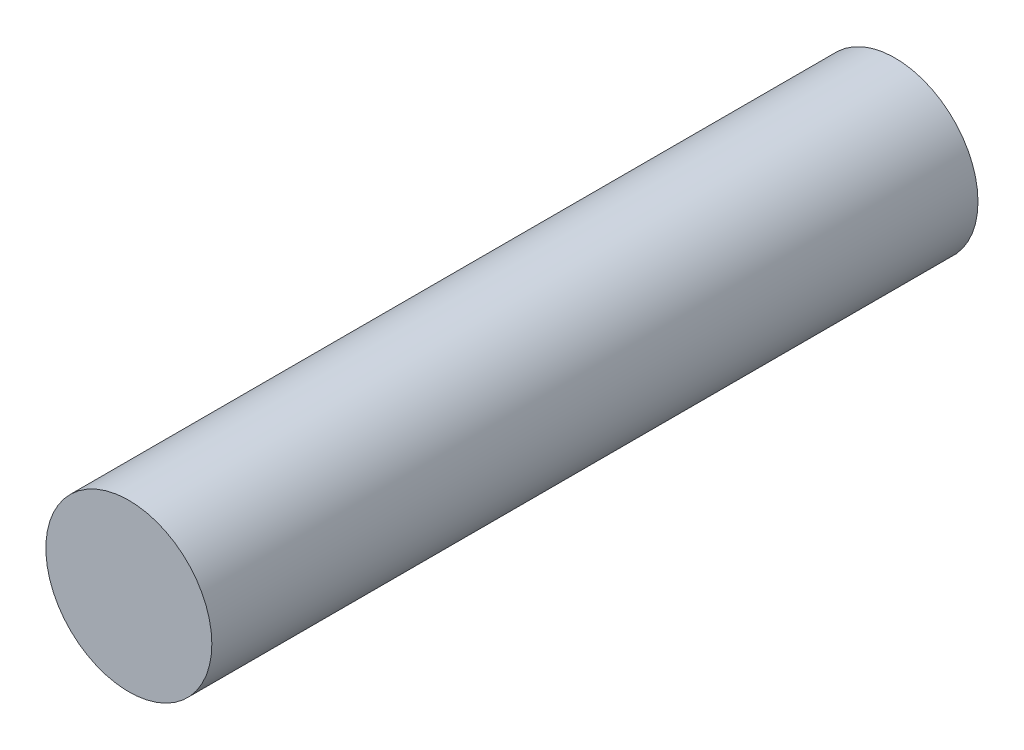
ISO-10303-21;
HEADER;
FILE_DESCRIPTION(('STEP AP214'),'2;1');
FILE_NAME('part.step','',(''),(''),'','','');
FILE_SCHEMA(('AUTOMOTIVE_DESIGN { 1 0 10303 214 1 1 1 1 }'));
ENDSEC;
DATA;
#1=APPLICATION_CONTEXT('core data for automotive mechanical design processes');
#2=APPLICATION_PROTOCOL_DEFINITION('international standard','automotive_design',2000,#1);
#3=PRODUCT_CONTEXT('',#1,'mechanical');
#4=PRODUCT('Part','Part','',(#3));
#5=PRODUCT_RELATED_PRODUCT_CATEGORY('part','',(#4));
#6=PRODUCT_DEFINITION_FORMATION('','',#4);
#7=PRODUCT_DEFINITION_CONTEXT('part definition',#1,'design');
#8=PRODUCT_DEFINITION('design','',#6,#7);
#9=PRODUCT_DEFINITION_SHAPE('','',#8);
#10=(LENGTH_UNIT() NAMED_UNIT(*) SI_UNIT(.MILLI.,.METRE.));
#11=(NAMED_UNIT(*) PLANE_ANGLE_UNIT() SI_UNIT($,.RADIAN.));
#12=(NAMED_UNIT(*) SI_UNIT($,.STERADIAN.) SOLID_ANGLE_UNIT());
#13=UNCERTAINTY_MEASURE_WITH_UNIT(LENGTH_MEASURE(1.E-05),#10,'distance_accuracy_value','');
#14=(GEOMETRIC_REPRESENTATION_CONTEXT(3) GLOBAL_UNCERTAINTY_ASSIGNED_CONTEXT((#13)) GLOBAL_UNIT_ASSIGNED_CONTEXT((#10,
#11,#12)) REPRESENTATION_CONTEXT('',''));
#15=CARTESIAN_POINT('',(0.,0.,0.));
#16=DIRECTION('',(0.,0.,1.));
#17=DIRECTION('',(1.,0.,0.));
#18=AXIS2_PLACEMENT_3D('',#15,#16,#17);
#19=CARTESIAN_POINT('',(0.,0.,-29.9999999999999));
#20=DIRECTION('',(0.,0.,0.999999999999997));
#21=DIRECTION('',(0.999999999999999,0.,0.));
#22=AXIS2_PLACEMENT_3D('',#19,#20,#21);
#23=CYLINDRICAL_SURFACE('',#22,3.25);
#24=CARTESIAN_POINT('',(0.,0.,-29.9999999999999));
#25=DIRECTION('',(0.,0.,0.999999999999997));
#26=DIRECTION('',(0.999999999999999,0.,0.));
#27=AXIS2_PLACEMENT_3D('',#24,#25,#26);
#28=CIRCLE('',#27,3.25);
#29=CARTESIAN_POINT('',(3.25,0.,-29.9999999999999));
#30=VERTEX_POINT('',#29);
#31=EDGE_CURVE('E12',#30,#30,#28,.T.);
#32=ORIENTED_EDGE('',*,*,#31,.T.);
#33=EDGE_LOOP('',(#32));
#34=FACE_BOUND('',#33,.T.);
#35=CARTESIAN_POINT('',(0.,0.,0.));
#36=DIRECTION('',(0.,0.,0.999999999999997));
#37=DIRECTION('',(0.999999999999999,0.,0.));
#38=AXIS2_PLACEMENT_3D('',#35,#36,#37);
#39=CIRCLE('',#38,3.25);
#40=CARTESIAN_POINT('',(3.25,0.,0.));
#41=VERTEX_POINT('',#40);
#42=EDGE_CURVE('E41',#41,#41,#39,.T.);
#43=ORIENTED_EDGE('',*,*,#42,.F.);
#44=EDGE_LOOP('',(#43));
#45=FACE_BOUND('',#44,.T.);
#46=ADVANCED_FACE('F38',(#34,#45),#23,.T.);
#47=CARTESIAN_POINT('',(0.,0.,-29.9999999999999));
#48=DIRECTION('',(0.,0.,0.999999999999997));
#49=DIRECTION('',(0.999999999999999,0.,0.));
#50=AXIS2_PLACEMENT_3D('',#47,#48,#49);
#51=PLANE('',#50);
#52=ORIENTED_EDGE('',*,*,#31,.F.);
#53=EDGE_LOOP('',(#52));
#54=FACE_BOUND('',#53,.T.);
#55=ADVANCED_FACE('F53',(#54),#51,.F.);
#56=CARTESIAN_POINT('',(0.,0.,0.));
#57=DIRECTION('',(0.,0.,0.999999999999997));
#58=DIRECTION('',(0.999999999999999,0.,0.));
#59=AXIS2_PLACEMENT_3D('',#56,#57,#58);
#60=PLANE('',#59);
#61=ORIENTED_EDGE('',*,*,#42,.T.);
#62=EDGE_LOOP('',(#61));
#63=FACE_BOUND('',#62,.T.);
#64=ADVANCED_FACE('F50',(#63),#60,.T.);
#65=CLOSED_SHELL('',(#46,#55,#64));
#66=MANIFOLD_SOLID_BREP('B2',#65);
#67=ADVANCED_BREP_SHAPE_REPRESENTATION('',(#18,#66),#14);
#68=SHAPE_DEFINITION_REPRESENTATION(#9,#67);
ENDSEC;
END-ISO-10303-21;
